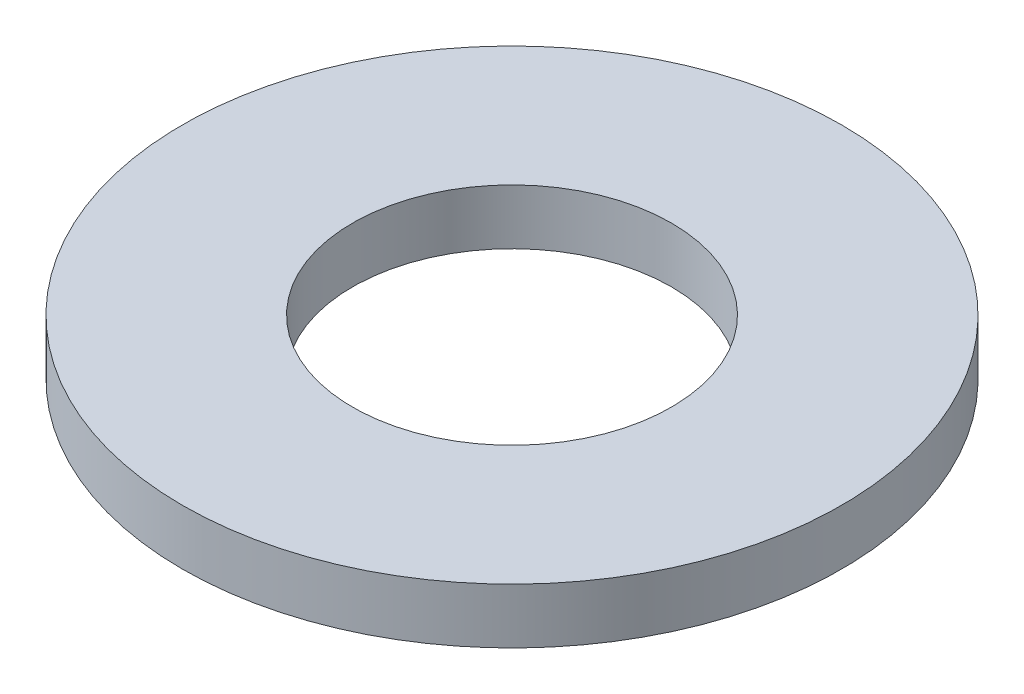
ISO-10303-21;
HEADER;
FILE_DESCRIPTION(('STEP AP214'),'2;1');
FILE_NAME('part.step','',(''),(''),'','','');
FILE_SCHEMA(('AUTOMOTIVE_DESIGN { 1 0 10303 214 1 1 1 1 }'));
ENDSEC;
DATA;
#1=APPLICATION_CONTEXT('core data for automotive mechanical design processes');
#2=APPLICATION_PROTOCOL_DEFINITION('international standard','automotive_design',2000,#1);
#3=PRODUCT_CONTEXT('',#1,'mechanical');
#4=PRODUCT('Part','Part','',(#3));
#5=PRODUCT_RELATED_PRODUCT_CATEGORY('part','',(#4));
#6=PRODUCT_DEFINITION_FORMATION('','',#4);
#7=PRODUCT_DEFINITION_CONTEXT('part definition',#1,'design');
#8=PRODUCT_DEFINITION('design','',#6,#7);
#9=PRODUCT_DEFINITION_SHAPE('','',#8);
#10=(LENGTH_UNIT() NAMED_UNIT(*) SI_UNIT(.MILLI.,.METRE.));
#11=(NAMED_UNIT(*) PLANE_ANGLE_UNIT() SI_UNIT($,.RADIAN.));
#12=(NAMED_UNIT(*) SI_UNIT($,.STERADIAN.) SOLID_ANGLE_UNIT());
#13=UNCERTAINTY_MEASURE_WITH_UNIT(LENGTH_MEASURE(1.E-05),#10,'distance_accuracy_value','');
#14=(GEOMETRIC_REPRESENTATION_CONTEXT(3) GLOBAL_UNCERTAINTY_ASSIGNED_CONTEXT((#13)) GLOBAL_UNIT_ASSIGNED_CONTEXT((#10,
#11,#12)) REPRESENTATION_CONTEXT('',''));
#15=CARTESIAN_POINT('',(0.,0.,0.));
#16=DIRECTION('',(0.,0.,1.));
#17=DIRECTION('',(1.,0.,0.));
#18=AXIS2_PLACEMENT_3D('',#15,#16,#17);
#19=CARTESIAN_POINT('',(0.,13.,0.));
#20=DIRECTION('',(0.,-1.,0.));
#21=DIRECTION('',(0.,0.,-1.));
#22=AXIS2_PLACEMENT_3D('',#19,#20,#21);
#23=CYLINDRICAL_SURFACE('',#22,77.5);
#24=CARTESIAN_POINT('',(0.,13.,0.));
#25=DIRECTION('',(0.,1.,0.));
#26=DIRECTION('',(0.,0.,1.));
#27=AXIS2_PLACEMENT_3D('',#24,#25,#26);
#28=CIRCLE('',#27,77.5);
#29=CARTESIAN_POINT('',(0.,13.,-77.5));
#30=VERTEX_POINT('',#29);
#31=EDGE_CURVE('E10',#30,#30,#28,.T.);
#32=CARTESIAN_POINT('',(0.,0.,0.));
#33=DIRECTION('',(0.,1.,0.));
#34=DIRECTION('',(0.,0.,1.));
#35=AXIS2_PLACEMENT_3D('',#32,#33,#34);
#36=CIRCLE('',#35,77.5);
#37=CARTESIAN_POINT('',(0.,0.,-77.5));
#38=VERTEX_POINT('',#37);
#39=EDGE_CURVE('E37',#38,#38,#36,.T.);
#40=CARTESIAN_POINT('',(0.,13.,-77.5));
#41=CARTESIAN_POINT('',(0.,12.8645833333333,-77.5));
#42=CARTESIAN_POINT('',(0.,12.7291666666667,-77.5));
#43=CARTESIAN_POINT('',(0.,12.4583333333333,-77.5));
#44=CARTESIAN_POINT('',(0.,12.3229166666667,-77.5));
#45=CARTESIAN_POINT('',(0.,12.0520833333333,-77.5));
#46=CARTESIAN_POINT('',(0.,11.9166666666667,-77.5));
#47=CARTESIAN_POINT('',(0.,11.6458333333333,-77.5));
#48=CARTESIAN_POINT('',(0.,11.5104166666667,-77.5));
#49=CARTESIAN_POINT('',(0.,11.2395833333333,-77.5));
#50=CARTESIAN_POINT('',(0.,11.1041666666667,-77.5));
#51=CARTESIAN_POINT('',(0.,10.8333333333333,-77.5));
#52=CARTESIAN_POINT('',(0.,10.6979166666667,-77.5));
#53=CARTESIAN_POINT('',(0.,10.4270833333333,-77.5));
#54=CARTESIAN_POINT('',(0.,10.2916666666667,-77.5));
#55=CARTESIAN_POINT('',(0.,10.0208333333333,-77.5));
#56=CARTESIAN_POINT('',(0.,9.88541666666667,-77.5));
#57=CARTESIAN_POINT('',(0.,9.61458333333333,-77.5));
#58=CARTESIAN_POINT('',(0.,9.47916666666667,-77.5));
#59=CARTESIAN_POINT('',(0.,9.20833333333333,-77.5));
#60=CARTESIAN_POINT('',(0.,9.07291666666666,-77.5));
#61=CARTESIAN_POINT('',(0.,8.80208333333333,-77.5));
#62=CARTESIAN_POINT('',(0.,8.66666666666667,-77.5));
#63=CARTESIAN_POINT('',(0.,8.39583333333333,-77.5));
#64=CARTESIAN_POINT('',(0.,8.26041666666667,-77.5));
#65=CARTESIAN_POINT('',(0.,7.98958333333333,-77.5));
#66=CARTESIAN_POINT('',(0.,7.85416666666667,-77.5));
#67=CARTESIAN_POINT('',(0.,7.58333333333333,-77.5));
#68=CARTESIAN_POINT('',(0.,7.44791666666667,-77.5));
#69=CARTESIAN_POINT('',(0.,7.17708333333333,-77.5));
#70=CARTESIAN_POINT('',(0.,7.04166666666667,-77.5));
#71=CARTESIAN_POINT('',(0.,6.77083333333333,-77.5));
#72=CARTESIAN_POINT('',(0.,6.63541666666667,-77.5));
#73=CARTESIAN_POINT('',(0.,6.36458333333333,-77.5));
#74=CARTESIAN_POINT('',(0.,6.22916666666667,-77.5));
#75=CARTESIAN_POINT('',(0.,5.95833333333333,-77.5));
#76=CARTESIAN_POINT('',(0.,5.82291666666667,-77.5));
#77=CARTESIAN_POINT('',(0.,5.55208333333333,-77.5));
#78=CARTESIAN_POINT('',(0.,5.41666666666667,-77.5));
#79=CARTESIAN_POINT('',(0.,5.14583333333333,-77.5));
#80=CARTESIAN_POINT('',(0.,5.01041666666667,-77.5));
#81=CARTESIAN_POINT('',(0.,4.73958333333333,-77.5));
#82=CARTESIAN_POINT('',(0.,4.60416666666667,-77.5));
#83=CARTESIAN_POINT('',(0.,4.33333333333333,-77.5));
#84=CARTESIAN_POINT('',(0.,4.19791666666667,-77.5));
#85=CARTESIAN_POINT('',(0.,3.92708333333333,-77.5));
#86=CARTESIAN_POINT('',(0.,3.79166666666667,-77.5));
#87=CARTESIAN_POINT('',(0.,3.52083333333333,-77.5));
#88=CARTESIAN_POINT('',(0.,3.38541666666667,-77.5));
#89=CARTESIAN_POINT('',(0.,3.11458333333333,-77.5));
#90=CARTESIAN_POINT('',(0.,2.97916666666667,-77.5));
#91=CARTESIAN_POINT('',(0.,2.70833333333333,-77.5));
#92=CARTESIAN_POINT('',(0.,2.57291666666667,-77.5));
#93=CARTESIAN_POINT('',(0.,2.30208333333333,-77.5));
#94=CARTESIAN_POINT('',(0.,2.16666666666667,-77.5));
#95=CARTESIAN_POINT('',(0.,1.89583333333333,-77.5));
#96=CARTESIAN_POINT('',(0.,1.76041666666667,-77.5));
#97=CARTESIAN_POINT('',(0.,1.48958333333333,-77.5));
#98=CARTESIAN_POINT('',(0.,1.35416666666667,-77.5));
#99=CARTESIAN_POINT('',(0.,1.08333333333333,-77.5));
#100=CARTESIAN_POINT('',(0.,0.947916666666667,-77.5));
#101=CARTESIAN_POINT('',(0.,0.677083333333334,-77.5));
#102=CARTESIAN_POINT('',(0.,0.541666666666667,-77.5));
#103=CARTESIAN_POINT('',(0.,0.270833333333334,-77.5));
#104=CARTESIAN_POINT('',(0.,0.135416666666667,-77.5));
#105=CARTESIAN_POINT('',(0.,0.,-77.5));
#106=B_SPLINE_CURVE_WITH_KNOTS('',3,(#40,#41,#42,#43,#44,#45,#46,#47,#48,#49,#50,#51,#52,#53,
#54,#55,#56,#57,#58,#59,#60,#61,#62,#63,#64,#65,#66,#67,#68,#69,#70,#71,#72,#73,#74,#75,#76,#77,
#78,#79,#80,#81,#82,#83,#84,#85,#86,#87,#88,#89,#90,#91,#92,#93,#94,#95,#96,#97,#98,#99,#100,
#101,#102,#103,#104,#105),.UNSPECIFIED.,.F.,.F.,(4,2,2,2,2,2,2,2,2,2,2,2,2,2,2,2,2,2,2,2,2,2,2,
2,2,2,2,2,2,2,2,2,4),(0.,0.40625,0.812500000000001,1.21875,1.625,2.03125,2.4375,2.84375,3.25,
3.65625,4.0625,4.46875,4.875,5.28125,5.6875,6.09375,6.5,6.90625,7.3125,7.71875,8.125,8.53125,
8.9375,9.34375,9.75,10.15625,10.5625,10.96875,11.375,11.78125,12.1875,12.59375,13.),.UNSPECIFIED.);
#107=EDGE_CURVE('BSEAM40',#30,#38,#106,.T.);
#108=ORIENTED_EDGE('',*,*,#31,.F.);
#109=ORIENTED_EDGE('',*,*,#39,.T.);
#110=ORIENTED_EDGE('',*,*,#107,.T.);
#111=ORIENTED_EDGE('',*,*,#107,.F.);
#112=EDGE_LOOP('',(#108,#110,#109,#111));
#113=FACE_BOUND('',#112,.T.);
#114=ADVANCED_FACE('F40',(#113),#23,.T.);
#115=CARTESIAN_POINT('',(0.,13.,0.));
#116=DIRECTION('',(0.,1.,0.));
#117=DIRECTION('',(0.,0.,1.));
#118=AXIS2_PLACEMENT_3D('',#115,#116,#117);
#119=PLANE('',#118);
#120=CARTESIAN_POINT('',(0.,13.,0.));
#121=DIRECTION('',(0.,1.,0.));
#122=DIRECTION('',(0.,0.,1.));
#123=AXIS2_PLACEMENT_3D('',#120,#121,#122);
#124=CIRCLE('',#123,37.5);
#125=CARTESIAN_POINT('',(0.,13.,-37.5));
#126=VERTEX_POINT('',#125);
#127=EDGE_CURVE('E50',#126,#126,#124,.T.);
#128=ORIENTED_EDGE('',*,*,#127,.F.);
#129=EDGE_LOOP('',(#128));
#130=FACE_BOUND('',#129,.T.);
#131=ORIENTED_EDGE('',*,*,#31,.T.);
#132=EDGE_LOOP('',(#131));
#133=FACE_BOUND('',#132,.T.);
#134=ADVANCED_FACE('F59',(#130,#133),#119,.T.);
#135=CARTESIAN_POINT('',(0.,0.,0.));
#136=DIRECTION('',(0.,1.,0.));
#137=DIRECTION('',(0.,0.,1.));
#138=AXIS2_PLACEMENT_3D('',#135,#136,#137);
#139=PLANE('',#138);
#140=CARTESIAN_POINT('',(0.,0.,0.));
#141=DIRECTION('',(0.,1.,0.));
#142=DIRECTION('',(0.,0.,1.));
#143=AXIS2_PLACEMENT_3D('',#140,#141,#142);
#144=CIRCLE('',#143,37.5);
#145=CARTESIAN_POINT('',(0.,0.,-37.5));
#146=VERTEX_POINT('',#145);
#147=EDGE_CURVE('E47',#146,#146,#144,.T.);
#148=ORIENTED_EDGE('',*,*,#147,.T.);
#149=EDGE_LOOP('',(#148));
#150=FACE_BOUND('',#149,.T.);
#151=ORIENTED_EDGE('',*,*,#39,.F.);
#152=EDGE_LOOP('',(#151));
#153=FACE_BOUND('',#152,.T.);
#154=ADVANCED_FACE('F58',(#150,#153),#139,.F.);
#155=CARTESIAN_POINT('',(0.,13.,0.));
#156=DIRECTION('',(0.,-1.,0.));
#157=DIRECTION('',(0.,0.,-1.));
#158=AXIS2_PLACEMENT_3D('',#155,#156,#157);
#159=CYLINDRICAL_SURFACE('',#158,37.5);
#160=CARTESIAN_POINT('',(0.,13.,-37.5));
#161=CARTESIAN_POINT('',(0.,12.8645833333333,-37.5));
#162=CARTESIAN_POINT('',(0.,12.7291666666667,-37.5));
#163=CARTESIAN_POINT('',(0.,12.4583333333333,-37.5));
#164=CARTESIAN_POINT('',(0.,12.3229166666667,-37.5));
#165=CARTESIAN_POINT('',(0.,12.0520833333333,-37.5));
#166=CARTESIAN_POINT('',(0.,11.9166666666667,-37.5));
#167=CARTESIAN_POINT('',(0.,11.6458333333333,-37.5));
#168=CARTESIAN_POINT('',(0.,11.5104166666667,-37.5));
#169=CARTESIAN_POINT('',(0.,11.2395833333333,-37.5));
#170=CARTESIAN_POINT('',(0.,11.1041666666667,-37.5));
#171=CARTESIAN_POINT('',(0.,10.8333333333333,-37.5));
#172=CARTESIAN_POINT('',(0.,10.6979166666667,-37.5));
#173=CARTESIAN_POINT('',(0.,10.4270833333333,-37.5));
#174=CARTESIAN_POINT('',(0.,10.2916666666667,-37.5));
#175=CARTESIAN_POINT('',(0.,10.0208333333333,-37.5));
#176=CARTESIAN_POINT('',(0.,9.88541666666667,-37.5));
#177=CARTESIAN_POINT('',(0.,9.61458333333333,-37.5));
#178=CARTESIAN_POINT('',(0.,9.47916666666667,-37.5));
#179=CARTESIAN_POINT('',(0.,9.20833333333333,-37.5));
#180=CARTESIAN_POINT('',(0.,9.07291666666666,-37.5));
#181=CARTESIAN_POINT('',(0.,8.80208333333333,-37.5));
#182=CARTESIAN_POINT('',(0.,8.66666666666667,-37.5));
#183=CARTESIAN_POINT('',(0.,8.39583333333333,-37.5));
#184=CARTESIAN_POINT('',(0.,8.26041666666667,-37.5));
#185=CARTESIAN_POINT('',(0.,7.98958333333333,-37.5));
#186=CARTESIAN_POINT('',(0.,7.85416666666667,-37.5));
#187=CARTESIAN_POINT('',(0.,7.58333333333333,-37.5));
#188=CARTESIAN_POINT('',(0.,7.44791666666667,-37.5));
#189=CARTESIAN_POINT('',(0.,7.17708333333333,-37.5));
#190=CARTESIAN_POINT('',(0.,7.04166666666667,-37.5));
#191=CARTESIAN_POINT('',(0.,6.77083333333333,-37.5));
#192=CARTESIAN_POINT('',(0.,6.63541666666667,-37.5));
#193=CARTESIAN_POINT('',(0.,6.36458333333333,-37.5));
#194=CARTESIAN_POINT('',(0.,6.22916666666667,-37.5));
#195=CARTESIAN_POINT('',(0.,5.95833333333333,-37.5));
#196=CARTESIAN_POINT('',(0.,5.82291666666667,-37.5));
#197=CARTESIAN_POINT('',(0.,5.55208333333333,-37.5));
#198=CARTESIAN_POINT('',(0.,5.41666666666667,-37.5));
#199=CARTESIAN_POINT('',(0.,5.14583333333333,-37.5));
#200=CARTESIAN_POINT('',(0.,5.01041666666667,-37.5));
#201=CARTESIAN_POINT('',(0.,4.73958333333333,-37.5));
#202=CARTESIAN_POINT('',(0.,4.60416666666667,-37.5));
#203=CARTESIAN_POINT('',(0.,4.33333333333333,-37.5));
#204=CARTESIAN_POINT('',(0.,4.19791666666667,-37.5));
#205=CARTESIAN_POINT('',(0.,3.92708333333333,-37.5));
#206=CARTESIAN_POINT('',(0.,3.79166666666667,-37.5));
#207=CARTESIAN_POINT('',(0.,3.52083333333333,-37.5));
#208=CARTESIAN_POINT('',(0.,3.38541666666667,-37.5));
#209=CARTESIAN_POINT('',(0.,3.11458333333333,-37.5));
#210=CARTESIAN_POINT('',(0.,2.97916666666667,-37.5));
#211=CARTESIAN_POINT('',(0.,2.70833333333333,-37.5));
#212=CARTESIAN_POINT('',(0.,2.57291666666667,-37.5));
#213=CARTESIAN_POINT('',(0.,2.30208333333333,-37.5));
#214=CARTESIAN_POINT('',(0.,2.16666666666667,-37.5));
#215=CARTESIAN_POINT('',(0.,1.89583333333333,-37.5));
#216=CARTESIAN_POINT('',(0.,1.76041666666667,-37.5));
#217=CARTESIAN_POINT('',(0.,1.48958333333333,-37.5));
#218=CARTESIAN_POINT('',(0.,1.35416666666667,-37.5));
#219=CARTESIAN_POINT('',(0.,1.08333333333333,-37.5));
#220=CARTESIAN_POINT('',(0.,0.947916666666667,-37.5));
#221=CARTESIAN_POINT('',(0.,0.677083333333334,-37.5));
#222=CARTESIAN_POINT('',(0.,0.541666666666667,-37.5));
#223=CARTESIAN_POINT('',(0.,0.270833333333334,-37.5));
#224=CARTESIAN_POINT('',(0.,0.135416666666667,-37.5));
#225=CARTESIAN_POINT('',(0.,0.,-37.5));
#226=B_SPLINE_CURVE_WITH_KNOTS('',3,(#160,#161,#162,#163,#164,#165,#166,#167,#168,#169,#170,
#171,#172,#173,#174,#175,#176,#177,#178,#179,#180,#181,#182,#183,#184,#185,#186,#187,#188,#189,
#190,#191,#192,#193,#194,#195,#196,#197,#198,#199,#200,#201,#202,#203,#204,#205,#206,#207,#208,
#209,#210,#211,#212,#213,#214,#215,#216,#217,#218,#219,#220,#221,#222,#223,#224,#225),
.UNSPECIFIED.,.F.,.F.,(4,2,2,2,2,2,2,2,2,2,2,2,2,2,2,2,2,2,2,2,2,2,2,2,2,2,2,2,2,2,2,2,4),(0.,
0.40625,0.812500000000001,1.21875,1.625,2.03125,2.4375,2.84375,3.25,3.65625,4.0625,4.46875,
4.875,5.28125,5.6875,6.09375,6.5,6.90625,7.3125,7.71875,8.125,8.53125,8.9375,9.34375,9.75,
10.15625,10.5625,10.96875,11.375,11.78125,12.1875,12.59375,13.),.UNSPECIFIED.);
#227=EDGE_CURVE('BSEAM54',#126,#146,#226,.T.);
#228=ORIENTED_EDGE('',*,*,#127,.T.);
#229=ORIENTED_EDGE('',*,*,#147,.F.);
#230=ORIENTED_EDGE('',*,*,#227,.T.);
#231=ORIENTED_EDGE('',*,*,#227,.F.);
#232=EDGE_LOOP('',(#228,#230,#229,#231));
#233=FACE_BOUND('',#232,.T.);
#234=ADVANCED_FACE('F54',(#233),#159,.F.);
#235=CLOSED_SHELL('',(#114,#134,#154,#234));
#236=MANIFOLD_SOLID_BREP('B2',#235);
#237=ADVANCED_BREP_SHAPE_REPRESENTATION('',(#18,#236),#14);
#238=SHAPE_DEFINITION_REPRESENTATION(#9,#237);
ENDSEC;
END-ISO-10303-21;
